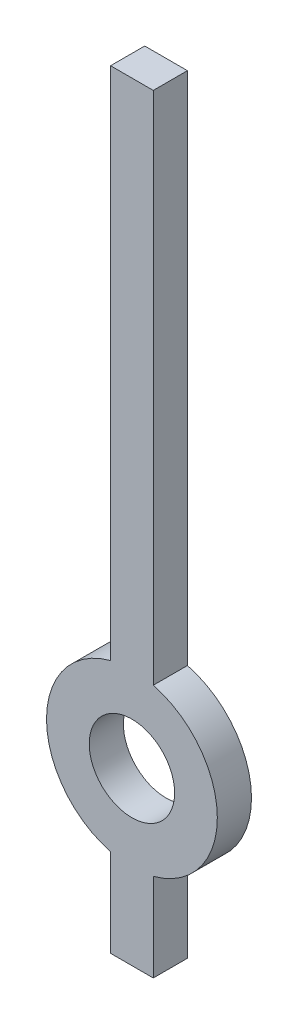
ISO-10303-21;
HEADER;
FILE_DESCRIPTION(('STEP AP214'),'2;1');
FILE_NAME('part.step','',(''),(''),'','','');
FILE_SCHEMA(('AUTOMOTIVE_DESIGN { 1 0 10303 214 1 1 1 1 }'));
ENDSEC;
DATA;
#1=APPLICATION_CONTEXT('core data for automotive mechanical design processes');
#2=APPLICATION_PROTOCOL_DEFINITION('international standard','automotive_design',2000,#1);
#3=PRODUCT_CONTEXT('',#1,'mechanical');
#4=PRODUCT('Part','Part','',(#3));
#5=PRODUCT_RELATED_PRODUCT_CATEGORY('part','',(#4));
#6=PRODUCT_DEFINITION_FORMATION('','',#4);
#7=PRODUCT_DEFINITION_CONTEXT('part definition',#1,'design');
#8=PRODUCT_DEFINITION('design','',#6,#7);
#9=PRODUCT_DEFINITION_SHAPE('','',#8);
#10=(LENGTH_UNIT() NAMED_UNIT(*) SI_UNIT(.MILLI.,.METRE.));
#11=(NAMED_UNIT(*) PLANE_ANGLE_UNIT() SI_UNIT($,.RADIAN.));
#12=(NAMED_UNIT(*) SI_UNIT($,.STERADIAN.) SOLID_ANGLE_UNIT());
#13=UNCERTAINTY_MEASURE_WITH_UNIT(LENGTH_MEASURE(1.E-05),#10,'distance_accuracy_value','');
#14=(GEOMETRIC_REPRESENTATION_CONTEXT(3) GLOBAL_UNCERTAINTY_ASSIGNED_CONTEXT((#13)) GLOBAL_UNIT_ASSIGNED_CONTEXT((#10,
#11,#12)) REPRESENTATION_CONTEXT('',''));
#15=CARTESIAN_POINT('',(0.,0.,0.));
#16=DIRECTION('',(0.,0.,1.));
#17=DIRECTION('',(1.,0.,0.));
#18=AXIS2_PLACEMENT_3D('',#15,#16,#17);
#19=CARTESIAN_POINT('',(0.,0.,0.2));
#20=DIRECTION('',(0.,0.,1.));
#21=DIRECTION('',(1.,0.,0.));
#22=AXIS2_PLACEMENT_3D('',#19,#20,#21);
#23=PLANE('',#22);
#24=DIRECTION('',(1.,0.,0.));
#25=VECTOR('',#24,1.);
#26=CARTESIAN_POINT('',(0.125,-1.,0.2));
#27=LINE('',#26,#25);
#28=CARTESIAN_POINT('',(-0.125,-1.,0.2));
#29=VERTEX_POINT('',#28);
#30=CARTESIAN_POINT('',(0.125,-1.,0.2));
#31=VERTEX_POINT('',#30);
#32=EDGE_CURVE('E148',#29,#31,#27,.T.);
#33=ORIENTED_EDGE('',*,*,#32,.T.);
#34=DIRECTION('',(0.,1.,0.));
#35=VECTOR('',#34,1.);
#36=CARTESIAN_POINT('',(0.125,-0.484122918275928,0.2));
#37=LINE('',#36,#35);
#38=CARTESIAN_POINT('',(0.125,-0.484122918275928,0.2));
#39=VERTEX_POINT('',#38);
#40=EDGE_CURVE('E96',#31,#39,#37,.T.);
#41=ORIENTED_EDGE('',*,*,#40,.T.);
#42=CARTESIAN_POINT('',(0.,0.,0.2));
#43=DIRECTION('',(0.,0.,1.));
#44=DIRECTION('',(1.,0.,0.));
#45=AXIS2_PLACEMENT_3D('',#42,#43,#44);
#46=CIRCLE('',#45,0.5);
#47=CARTESIAN_POINT('',(0.125,0.484122918275928,0.2));
#48=VERTEX_POINT('',#47);
#49=EDGE_CURVE('E163',#39,#48,#46,.T.);
#50=ORIENTED_EDGE('',*,*,#49,.T.);
#51=DIRECTION('',(0.,1.,0.));
#52=VECTOR('',#51,1.);
#53=CARTESIAN_POINT('',(0.125,3.5,0.2));
#54=LINE('',#53,#52);
#55=CARTESIAN_POINT('',(0.125,3.5,0.2));
#56=VERTEX_POINT('',#55);
#57=EDGE_CURVE('E176',#48,#56,#54,.T.);
#58=ORIENTED_EDGE('',*,*,#57,.T.);
#59=DIRECTION('',(-1.,0.,0.));
#60=VECTOR('',#59,1.);
#61=CARTESIAN_POINT('',(-0.125,3.5,0.2));
#62=LINE('',#61,#60);
#63=CARTESIAN_POINT('',(-0.125,3.5,0.2));
#64=VERTEX_POINT('',#63);
#65=EDGE_CURVE('E115',#56,#64,#62,.T.);
#66=ORIENTED_EDGE('',*,*,#65,.T.);
#67=DIRECTION('',(0.,-1.,0.));
#68=VECTOR('',#67,1.);
#69=CARTESIAN_POINT('',(-0.125,0.484122918275928,0.2));
#70=LINE('',#69,#68);
#71=CARTESIAN_POINT('',(-0.125,0.484122918275928,0.2));
#72=VERTEX_POINT('',#71);
#73=EDGE_CURVE('E109',#64,#72,#70,.T.);
#74=ORIENTED_EDGE('',*,*,#73,.T.);
#75=CARTESIAN_POINT('',(0.,0.,0.2));
#76=DIRECTION('',(0.,0.,1.));
#77=DIRECTION('',(1.,0.,0.));
#78=AXIS2_PLACEMENT_3D('',#75,#76,#77);
#79=CIRCLE('',#78,0.5);
#80=CARTESIAN_POINT('',(-0.125,-0.484122918275928,0.2));
#81=VERTEX_POINT('',#80);
#82=EDGE_CURVE('E113',#72,#81,#79,.T.);
#83=ORIENTED_EDGE('',*,*,#82,.T.);
#84=DIRECTION('',(0.,-1.,0.));
#85=VECTOR('',#84,1.);
#86=CARTESIAN_POINT('',(-0.125,-1.,0.2));
#87=LINE('',#86,#85);
#88=EDGE_CURVE('E53',#81,#29,#87,.T.);
#89=ORIENTED_EDGE('',*,*,#88,.T.);
#90=EDGE_LOOP('',(#33,#41,#50,#58,#66,#74,#83,#89));
#91=FACE_BOUND('',#90,.T.);
#92=CARTESIAN_POINT('',(0.,0.,0.2));
#93=DIRECTION('',(0.,0.,1.));
#94=DIRECTION('',(1.,0.,0.));
#95=AXIS2_PLACEMENT_3D('',#92,#93,#94);
#96=CIRCLE('',#95,0.25);
#97=CARTESIAN_POINT('',(0.25,0.,0.2));
#98=VERTEX_POINT('',#97);
#99=EDGE_CURVE('E137',#98,#98,#96,.T.);
#100=ORIENTED_EDGE('',*,*,#99,.F.);
#101=EDGE_LOOP('',(#100));
#102=FACE_BOUND('',#101,.T.);
#103=ADVANCED_FACE('F36',(#91,#102),#23,.T.);
#104=CARTESIAN_POINT('',(0.,0.,0.));
#105=DIRECTION('',(0.,0.,1.));
#106=DIRECTION('',(1.,0.,0.));
#107=AXIS2_PLACEMENT_3D('',#104,#105,#106);
#108=PLANE('',#107);
#109=DIRECTION('',(1.,0.,0.));
#110=VECTOR('',#109,1.);
#111=CARTESIAN_POINT('',(0.125,-1.,0.));
#112=LINE('',#111,#110);
#113=CARTESIAN_POINT('',(-0.125,-1.,0.));
#114=VERTEX_POINT('',#113);
#115=CARTESIAN_POINT('',(0.125,-1.,0.));
#116=VERTEX_POINT('',#115);
#117=EDGE_CURVE('E133',#114,#116,#112,.T.);
#118=ORIENTED_EDGE('',*,*,#117,.F.);
#119=DIRECTION('',(0.,-1.,0.));
#120=VECTOR('',#119,1.);
#121=CARTESIAN_POINT('',(-0.125,-1.,0.));
#122=LINE('',#121,#120);
#123=CARTESIAN_POINT('',(-0.125,-0.484122918275928,0.));
#124=VERTEX_POINT('',#123);
#125=EDGE_CURVE('E88',#124,#114,#122,.T.);
#126=ORIENTED_EDGE('',*,*,#125,.F.);
#127=CARTESIAN_POINT('',(0.,0.,0.));
#128=DIRECTION('',(0.,0.,1.));
#129=DIRECTION('',(1.,0.,0.));
#130=AXIS2_PLACEMENT_3D('',#127,#128,#129);
#131=CIRCLE('',#130,0.5);
#132=CARTESIAN_POINT('',(-0.125,0.484122918275928,0.));
#133=VERTEX_POINT('',#132);
#134=EDGE_CURVE('E82',#133,#124,#131,.T.);
#135=ORIENTED_EDGE('',*,*,#134,.F.);
#136=DIRECTION('',(0.,-1.,0.));
#137=VECTOR('',#136,1.);
#138=CARTESIAN_POINT('',(-0.125,0.484122918275928,0.));
#139=LINE('',#138,#137);
#140=CARTESIAN_POINT('',(-0.125,3.5,0.));
#141=VERTEX_POINT('',#140);
#142=EDGE_CURVE('E123',#141,#133,#139,.T.);
#143=ORIENTED_EDGE('',*,*,#142,.F.);
#144=DIRECTION('',(-1.,0.,0.));
#145=VECTOR('',#144,1.);
#146=CARTESIAN_POINT('',(-0.125,3.5,0.));
#147=LINE('',#146,#145);
#148=CARTESIAN_POINT('',(0.125,3.5,0.));
#149=VERTEX_POINT('',#148);
#150=EDGE_CURVE('E143',#149,#141,#147,.T.);
#151=ORIENTED_EDGE('',*,*,#150,.F.);
#152=DIRECTION('',(0.,1.,0.));
#153=VECTOR('',#152,1.);
#154=CARTESIAN_POINT('',(0.125,3.5,0.));
#155=LINE('',#154,#153);
#156=CARTESIAN_POINT('',(0.125,0.484122918275928,0.));
#157=VERTEX_POINT('',#156);
#158=EDGE_CURVE('E141',#157,#149,#155,.T.);
#159=ORIENTED_EDGE('',*,*,#158,.F.);
#160=CARTESIAN_POINT('',(0.,0.,0.));
#161=DIRECTION('',(0.,0.,1.));
#162=DIRECTION('',(1.,0.,0.));
#163=AXIS2_PLACEMENT_3D('',#160,#161,#162);
#164=CIRCLE('',#163,0.5);
#165=CARTESIAN_POINT('',(0.125,-0.484122918275928,0.));
#166=VERTEX_POINT('',#165);
#167=EDGE_CURVE('E139',#166,#157,#164,.T.);
#168=ORIENTED_EDGE('',*,*,#167,.F.);
#169=DIRECTION('',(0.,1.,0.));
#170=VECTOR('',#169,1.);
#171=CARTESIAN_POINT('',(0.125,-0.484122918275928,0.));
#172=LINE('',#171,#170);
#173=EDGE_CURVE('E136',#116,#166,#172,.T.);
#174=ORIENTED_EDGE('',*,*,#173,.F.);
#175=EDGE_LOOP('',(#118,#126,#135,#143,#151,#159,#168,#174));
#176=FACE_BOUND('',#175,.T.);
#177=CARTESIAN_POINT('',(0.,0.,0.));
#178=DIRECTION('',(0.,0.,1.));
#179=DIRECTION('',(1.,0.,0.));
#180=AXIS2_PLACEMENT_3D('',#177,#178,#179);
#181=CIRCLE('',#180,0.25);
#182=CARTESIAN_POINT('',(0.25,0.,0.));
#183=VERTEX_POINT('',#182);
#184=EDGE_CURVE('E182',#183,#183,#181,.T.);
#185=ORIENTED_EDGE('',*,*,#184,.T.);
#186=EDGE_LOOP('',(#185));
#187=FACE_BOUND('',#186,.T.);
#188=ADVANCED_FACE('F167',(#176,#187),#108,.F.);
#189=CARTESIAN_POINT('',(0.125,-1.,0.2));
#190=DIRECTION('',(0.,1.,0.));
#191=DIRECTION('',(0.,0.,1.));
#192=AXIS2_PLACEMENT_3D('',#189,#190,#191);
#193=PLANE('',#192);
#194=ORIENTED_EDGE('',*,*,#117,.T.);
#195=DIRECTION('',(0.,0.,-1.));
#196=VECTOR('',#195,1.);
#197=CARTESIAN_POINT('',(0.125,-1.,0.2));
#198=LINE('',#197,#196);
#199=EDGE_CURVE('E11',#31,#116,#198,.T.);
#200=ORIENTED_EDGE('',*,*,#199,.F.);
#201=ORIENTED_EDGE('',*,*,#32,.F.);
#202=DIRECTION('',(0.,0.,-1.));
#203=VECTOR('',#202,1.);
#204=CARTESIAN_POINT('',(-0.125,-1.,0.2));
#205=LINE('',#204,#203);
#206=EDGE_CURVE('E129',#29,#114,#205,.T.);
#207=ORIENTED_EDGE('',*,*,#206,.T.);
#208=EDGE_LOOP('',(#194,#200,#201,#207));
#209=FACE_BOUND('',#208,.T.);
#210=ADVANCED_FACE('F38',(#209),#193,.F.);
#211=CARTESIAN_POINT('',(0.125,-0.484122918275928,0.2));
#212=DIRECTION('',(-1.,0.,0.));
#213=DIRECTION('',(0.,0.,1.));
#214=AXIS2_PLACEMENT_3D('',#211,#212,#213);
#215=PLANE('',#214);
#216=ORIENTED_EDGE('',*,*,#173,.T.);
#217=DIRECTION('',(0.,0.,-1.));
#218=VECTOR('',#217,1.);
#219=CARTESIAN_POINT('',(0.125,-0.484122918275928,0.2));
#220=LINE('',#219,#218);
#221=EDGE_CURVE('E45',#39,#166,#220,.T.);
#222=ORIENTED_EDGE('',*,*,#221,.F.);
#223=ORIENTED_EDGE('',*,*,#40,.F.);
#224=ORIENTED_EDGE('',*,*,#199,.T.);
#225=EDGE_LOOP('',(#216,#222,#223,#224));
#226=FACE_BOUND('',#225,.T.);
#227=ADVANCED_FACE('F210',(#226),#215,.F.);
#228=CARTESIAN_POINT('',(0.,0.,0.2));
#229=DIRECTION('',(0.,0.,-1.));
#230=DIRECTION('',(-1.,0.,0.));
#231=AXIS2_PLACEMENT_3D('',#228,#229,#230);
#232=CYLINDRICAL_SURFACE('',#231,0.5);
#233=ORIENTED_EDGE('',*,*,#167,.T.);
#234=DIRECTION('',(0.,0.,-1.));
#235=VECTOR('',#234,1.);
#236=CARTESIAN_POINT('',(0.125,0.484122918275928,0.2));
#237=LINE('',#236,#235);
#238=EDGE_CURVE('E155',#48,#157,#237,.T.);
#239=ORIENTED_EDGE('',*,*,#238,.F.);
#240=ORIENTED_EDGE('',*,*,#49,.F.);
#241=ORIENTED_EDGE('',*,*,#221,.T.);
#242=EDGE_LOOP('',(#233,#239,#240,#241));
#243=FACE_BOUND('',#242,.T.);
#244=ADVANCED_FACE('F161',(#243),#232,.T.);
#245=CARTESIAN_POINT('',(0.125,3.5,0.2));
#246=DIRECTION('',(-1.,0.,0.));
#247=DIRECTION('',(0.,0.,1.));
#248=AXIS2_PLACEMENT_3D('',#245,#246,#247);
#249=PLANE('',#248);
#250=ORIENTED_EDGE('',*,*,#158,.T.);
#251=DIRECTION('',(0.,0.,-1.));
#252=VECTOR('',#251,1.);
#253=CARTESIAN_POINT('',(0.125,3.5,0.2));
#254=LINE('',#253,#252);
#255=EDGE_CURVE('E152',#56,#149,#254,.T.);
#256=ORIENTED_EDGE('',*,*,#255,.F.);
#257=ORIENTED_EDGE('',*,*,#57,.F.);
#258=ORIENTED_EDGE('',*,*,#238,.T.);
#259=EDGE_LOOP('',(#250,#256,#257,#258));
#260=FACE_BOUND('',#259,.T.);
#261=ADVANCED_FACE('F172',(#260),#249,.F.);
#262=CARTESIAN_POINT('',(-0.125,3.5,0.2));
#263=DIRECTION('',(0.,-1.,0.));
#264=DIRECTION('',(0.,0.,-1.));
#265=AXIS2_PLACEMENT_3D('',#262,#263,#264);
#266=PLANE('',#265);
#267=ORIENTED_EDGE('',*,*,#150,.T.);
#268=DIRECTION('',(0.,0.,-1.));
#269=VECTOR('',#268,1.);
#270=CARTESIAN_POINT('',(-0.125,3.5,0.2));
#271=LINE('',#270,#269);
#272=EDGE_CURVE('E124',#64,#141,#271,.T.);
#273=ORIENTED_EDGE('',*,*,#272,.F.);
#274=ORIENTED_EDGE('',*,*,#65,.F.);
#275=ORIENTED_EDGE('',*,*,#255,.T.);
#276=EDGE_LOOP('',(#267,#273,#274,#275));
#277=FACE_BOUND('',#276,.T.);
#278=ADVANCED_FACE('F175',(#277),#266,.F.);
#279=CARTESIAN_POINT('',(-0.125,0.484122918275928,0.2));
#280=DIRECTION('',(1.,0.,0.));
#281=DIRECTION('',(0.,0.,-1.));
#282=AXIS2_PLACEMENT_3D('',#279,#280,#281);
#283=PLANE('',#282);
#284=ORIENTED_EDGE('',*,*,#142,.T.);
#285=DIRECTION('',(0.,0.,-1.));
#286=VECTOR('',#285,1.);
#287=CARTESIAN_POINT('',(-0.125,0.484122918275928,0.2));
#288=LINE('',#287,#286);
#289=EDGE_CURVE('E120',#72,#133,#288,.T.);
#290=ORIENTED_EDGE('',*,*,#289,.F.);
#291=ORIENTED_EDGE('',*,*,#73,.F.);
#292=ORIENTED_EDGE('',*,*,#272,.T.);
#293=EDGE_LOOP('',(#284,#290,#291,#292));
#294=FACE_BOUND('',#293,.T.);
#295=ADVANCED_FACE('F121',(#294),#283,.F.);
#296=CARTESIAN_POINT('',(0.,0.,0.2));
#297=DIRECTION('',(0.,0.,-1.));
#298=DIRECTION('',(-1.,0.,0.));
#299=AXIS2_PLACEMENT_3D('',#296,#297,#298);
#300=CYLINDRICAL_SURFACE('',#299,0.5);
#301=ORIENTED_EDGE('',*,*,#134,.T.);
#302=DIRECTION('',(0.,0.,-1.));
#303=VECTOR('',#302,1.);
#304=CARTESIAN_POINT('',(-0.125,-0.484122918275928,0.2));
#305=LINE('',#304,#303);
#306=EDGE_CURVE('E125',#81,#124,#305,.T.);
#307=ORIENTED_EDGE('',*,*,#306,.F.);
#308=ORIENTED_EDGE('',*,*,#82,.F.);
#309=ORIENTED_EDGE('',*,*,#289,.T.);
#310=EDGE_LOOP('',(#301,#307,#308,#309));
#311=FACE_BOUND('',#310,.T.);
#312=ADVANCED_FACE('F127',(#311),#300,.T.);
#313=CARTESIAN_POINT('',(-0.125,-1.,0.2));
#314=DIRECTION('',(1.,0.,0.));
#315=DIRECTION('',(0.,0.,-1.));
#316=AXIS2_PLACEMENT_3D('',#313,#314,#315);
#317=PLANE('',#316);
#318=ORIENTED_EDGE('',*,*,#125,.T.);
#319=ORIENTED_EDGE('',*,*,#206,.F.);
#320=ORIENTED_EDGE('',*,*,#88,.F.);
#321=ORIENTED_EDGE('',*,*,#306,.T.);
#322=EDGE_LOOP('',(#318,#319,#320,#321));
#323=FACE_BOUND('',#322,.T.);
#324=ADVANCED_FACE('F198',(#323),#317,.F.);
#325=CARTESIAN_POINT('',(0.,0.,0.2));
#326=DIRECTION('',(0.,0.,-1.));
#327=DIRECTION('',(-1.,0.,0.));
#328=AXIS2_PLACEMENT_3D('',#325,#326,#327);
#329=CYLINDRICAL_SURFACE('',#328,0.25);
#330=ORIENTED_EDGE('',*,*,#99,.T.);
#331=EDGE_LOOP('',(#330));
#332=FACE_BOUND('',#331,.T.);
#333=ORIENTED_EDGE('',*,*,#184,.F.);
#334=EDGE_LOOP('',(#333));
#335=FACE_BOUND('',#334,.T.);
#336=ADVANCED_FACE('F188',(#332,#335),#329,.F.);
#337=CLOSED_SHELL('',(#103,#188,#210,#227,#244,#261,#278,#295,#312,#324,#336));
#338=MANIFOLD_SOLID_BREP('B2',#337);
#339=ADVANCED_BREP_SHAPE_REPRESENTATION('',(#18,#338),#14);
#340=SHAPE_DEFINITION_REPRESENTATION(#9,#339);
ENDSEC;
END-ISO-10303-21;
